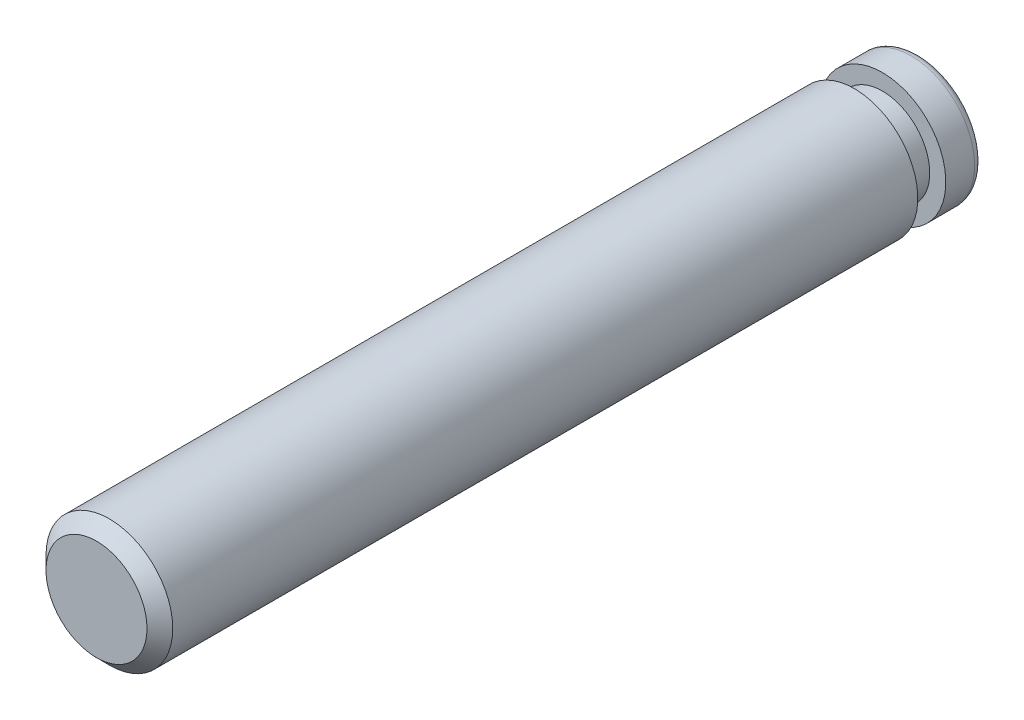
ISO-10303-21;
HEADER;
FILE_DESCRIPTION(('STEP AP214'),'2;1');
FILE_NAME('part.step','',(''),(''),'','','');
FILE_SCHEMA(('AUTOMOTIVE_DESIGN { 1 0 10303 214 1 1 1 1 }'));
ENDSEC;
DATA;
#1=APPLICATION_CONTEXT('core data for automotive mechanical design processes');
#2=APPLICATION_PROTOCOL_DEFINITION('international standard','automotive_design',2000,#1);
#3=PRODUCT_CONTEXT('',#1,'mechanical');
#4=PRODUCT('Part','Part','',(#3));
#5=PRODUCT_RELATED_PRODUCT_CATEGORY('part','',(#4));
#6=PRODUCT_DEFINITION_FORMATION('','',#4);
#7=PRODUCT_DEFINITION_CONTEXT('part definition',#1,'design');
#8=PRODUCT_DEFINITION('design','',#6,#7);
#9=PRODUCT_DEFINITION_SHAPE('','',#8);
#10=(LENGTH_UNIT() NAMED_UNIT(*) SI_UNIT(.MILLI.,.METRE.));
#11=(NAMED_UNIT(*) PLANE_ANGLE_UNIT() SI_UNIT($,.RADIAN.));
#12=(NAMED_UNIT(*) SI_UNIT($,.STERADIAN.) SOLID_ANGLE_UNIT());
#13=UNCERTAINTY_MEASURE_WITH_UNIT(LENGTH_MEASURE(1.E-05),#10,'distance_accuracy_value','');
#14=(GEOMETRIC_REPRESENTATION_CONTEXT(3) GLOBAL_UNCERTAINTY_ASSIGNED_CONTEXT((#13)) GLOBAL_UNIT_ASSIGNED_CONTEXT((#10,
#11,#12)) REPRESENTATION_CONTEXT('',''));
#15=CARTESIAN_POINT('',(0.,0.,0.));
#16=DIRECTION('',(0.,0.,1.));
#17=DIRECTION('',(1.,0.,0.));
#18=AXIS2_PLACEMENT_3D('',#15,#16,#17);
#19=CARTESIAN_POINT('',(0.,0.,12.7));
#20=DIRECTION('',(0.,0.,-1.));
#21=DIRECTION('',(-1.,0.,0.));
#22=AXIS2_PLACEMENT_3D('',#19,#20,#21);
#23=CYLINDRICAL_SURFACE('',#22,1.9558);
#24=CARTESIAN_POINT('',(0.,0.,12.303125));
#25=DIRECTION('',(0.,0.,1.));
#26=DIRECTION('',(1.,0.,0.));
#27=AXIS2_PLACEMENT_3D('',#24,#25,#26);
#28=CIRCLE('',#27,1.9558);
#29=CARTESIAN_POINT('',(1.9558,0.,12.303125));
#30=VERTEX_POINT('',#29);
#31=EDGE_CURVE('E10',#30,#30,#28,.F.);
#32=ORIENTED_EDGE('',*,*,#31,.T.);
#33=EDGE_LOOP('',(#32));
#34=FACE_BOUND('',#33,.T.);
#35=CARTESIAN_POINT('',(0.,0.,-10.6934));
#36=DIRECTION('',(0.,0.,-1.));
#37=DIRECTION('',(-1.,0.,0.));
#38=AXIS2_PLACEMENT_3D('',#35,#36,#37);
#39=CIRCLE('',#38,1.9558);
#40=CARTESIAN_POINT('',(-1.9558,0.,-10.6934));
#41=VERTEX_POINT('',#40);
#42=EDGE_CURVE('E53',#41,#41,#39,.T.);
#43=ORIENTED_EDGE('',*,*,#42,.F.);
#44=EDGE_LOOP('',(#43));
#45=FACE_BOUND('',#44,.T.);
#46=ADVANCED_FACE('F30',(#34,#45),#23,.T.);
#47=CARTESIAN_POINT('',(0.,0.,12.7));
#48=DIRECTION('',(0.,0.,1.));
#49=DIRECTION('',(1.,0.,0.));
#50=AXIS2_PLACEMENT_3D('',#47,#48,#49);
#51=PLANE('',#50);
#52=CARTESIAN_POINT('',(0.,0.,12.7));
#53=DIRECTION('',(0.,0.,1.));
#54=DIRECTION('',(1.,0.,0.));
#55=AXIS2_PLACEMENT_3D('',#52,#53,#54);
#56=CIRCLE('',#55,1.558925);
#57=CARTESIAN_POINT('',(1.558925,0.,12.7));
#58=VERTEX_POINT('',#57);
#59=EDGE_CURVE('E37',#58,#58,#56,.T.);
#60=ORIENTED_EDGE('',*,*,#59,.T.);
#61=EDGE_LOOP('',(#60));
#62=FACE_BOUND('',#61,.T.);
#63=ADVANCED_FACE('F69',(#62),#51,.T.);
#64=CARTESIAN_POINT('',(0.,0.,-10.042474892396));
#65=DIRECTION('',(0.,0.,-1.));
#66=DIRECTION('',(-1.,0.,0.));
#67=AXIS2_PLACEMENT_3D('',#64,#65,#66);
#68=CYLINDRICAL_SURFACE('',#67,1.4605);
#69=CARTESIAN_POINT('',(0.,0.,-10.6934));
#70=DIRECTION('',(0.,0.,-1.));
#71=DIRECTION('',(-1.,0.,0.));
#72=AXIS2_PLACEMENT_3D('',#69,#70,#71);
#73=CIRCLE('',#72,1.4605);
#74=CARTESIAN_POINT('',(-1.4605,0.,-10.6934));
#75=VERTEX_POINT('',#74);
#76=EDGE_CURVE('E50',#75,#75,#73,.T.);
#77=ORIENTED_EDGE('',*,*,#76,.T.);
#78=EDGE_LOOP('',(#77));
#79=FACE_BOUND('',#78,.T.);
#80=CARTESIAN_POINT('',(0.,0.,-11.557));
#81=DIRECTION('',(0.,0.,-1.));
#82=DIRECTION('',(-1.,0.,0.));
#83=AXIS2_PLACEMENT_3D('',#80,#81,#82);
#84=CIRCLE('',#83,1.4605);
#85=CARTESIAN_POINT('',(-1.4605,0.,-11.557));
#86=VERTEX_POINT('',#85);
#87=EDGE_CURVE('E59',#86,#86,#84,.T.);
#88=ORIENTED_EDGE('',*,*,#87,.F.);
#89=EDGE_LOOP('',(#88));
#90=FACE_BOUND('',#89,.T.);
#91=ADVANCED_FACE('F66',(#79,#90),#68,.T.);
#92=CARTESIAN_POINT('',(1.4605,0.,-10.6934));
#93=DIRECTION('',(0.,0.,-1.));
#94=DIRECTION('',(-1.,0.,0.));
#95=AXIS2_PLACEMENT_3D('',#92,#93,#94);
#96=PLANE('',#95);
#97=ORIENTED_EDGE('',*,*,#42,.T.);
#98=EDGE_LOOP('',(#97));
#99=FACE_BOUND('',#98,.T.);
#100=ORIENTED_EDGE('',*,*,#76,.F.);
#101=EDGE_LOOP('',(#100));
#102=FACE_BOUND('',#101,.T.);
#103=ADVANCED_FACE('F68',(#99,#102),#96,.T.);
#104=CARTESIAN_POINT('',(1.4605,0.,-11.557));
#105=DIRECTION('',(0.,0.,1.));
#106=DIRECTION('',(1.,0.,0.));
#107=AXIS2_PLACEMENT_3D('',#104,#105,#106);
#108=PLANE('',#107);
#109=ORIENTED_EDGE('',*,*,#87,.T.);
#110=EDGE_LOOP('',(#109));
#111=FACE_BOUND('',#110,.T.);
#112=CARTESIAN_POINT('',(0.,0.,-11.557));
#113=DIRECTION('',(0.,0.,-1.));
#114=DIRECTION('',(-1.,0.,0.));
#115=AXIS2_PLACEMENT_3D('',#112,#113,#114);
#116=CIRCLE('',#115,1.9558);
#117=CARTESIAN_POINT('',(-1.9558,0.,-11.557));
#118=VERTEX_POINT('',#117);
#119=EDGE_CURVE('E56',#118,#118,#116,.T.);
#120=ORIENTED_EDGE('',*,*,#119,.F.);
#121=EDGE_LOOP('',(#120));
#122=FACE_BOUND('',#121,.T.);
#123=ADVANCED_FACE('F63',(#111,#122),#108,.T.);
#124=CARTESIAN_POINT('',(0.,0.,-12.7));
#125=DIRECTION('',(0.,0.,1.));
#126=DIRECTION('',(1.,0.,0.));
#127=AXIS2_PLACEMENT_3D('',#124,#125,#126);
#128=PLANE('',#127);
#129=CARTESIAN_POINT('',(0.,0.,-12.7));
#130=DIRECTION('',(0.,0.,1.));
#131=DIRECTION('',(1.,0.,0.));
#132=AXIS2_PLACEMENT_3D('',#129,#130,#131);
#133=CIRCLE('',#132,1.7018);
#134=CARTESIAN_POINT('',(1.7018,0.,-12.7));
#135=VERTEX_POINT('',#134);
#136=EDGE_CURVE('E41',#135,#135,#133,.F.);
#137=ORIENTED_EDGE('',*,*,#136,.T.);
#138=EDGE_LOOP('',(#137));
#139=FACE_BOUND('',#138,.T.);
#140=ADVANCED_FACE('F88',(#139),#128,.F.);
#141=CARTESIAN_POINT('',(0.,0.,-12.446));
#142=DIRECTION('',(0.,0.,1.));
#143=DIRECTION('',(1.,0.,0.));
#144=AXIS2_PLACEMENT_3D('',#141,#142,#143);
#145=CIRCLE('',#144,1.9558);
#146=CARTESIAN_POINT('',(1.9558,0.,-12.446));
#147=VERTEX_POINT('',#146);
#148=EDGE_CURVE('E45',#147,#147,#145,.T.);
#149=ORIENTED_EDGE('',*,*,#148,.T.);
#150=EDGE_LOOP('',(#149));
#151=FACE_BOUND('',#150,.T.);
#152=ORIENTED_EDGE('',*,*,#119,.T.);
#153=EDGE_LOOP('',(#152));
#154=FACE_BOUND('',#153,.T.);
#155=ADVANCED_FACE('F81',(#151,#154),#23,.T.);
#156=CARTESIAN_POINT('',(0.,0.,-12.446));
#157=DIRECTION('',(0.,0.,1.));
#158=DIRECTION('',(1.,0.,0.));
#159=AXIS2_PLACEMENT_3D('',#156,#157,#158);
#160=TOROIDAL_SURFACE('',#159,1.7018,0.254);
#161=ORIENTED_EDGE('',*,*,#136,.F.);
#162=EDGE_LOOP('',(#161));
#163=FACE_BOUND('',#162,.T.);
#164=ORIENTED_EDGE('',*,*,#148,.F.);
#165=EDGE_LOOP('',(#164));
#166=FACE_BOUND('',#165,.T.);
#167=ADVANCED_FACE('F87',(#163,#166),#160,.T.);
#168=CARTESIAN_POINT('',(0.,0.,12.7));
#169=DIRECTION('',(0.,0.,-1.));
#170=DIRECTION('',(-1.,0.,0.));
#171=AXIS2_PLACEMENT_3D('',#168,#169,#170);
#172=CONICAL_SURFACE('',#171,1.558925,0.785398163397449);
#173=ORIENTED_EDGE('',*,*,#31,.F.);
#174=EDGE_LOOP('',(#173));
#175=FACE_BOUND('',#174,.T.);
#176=ORIENTED_EDGE('',*,*,#59,.F.);
#177=EDGE_LOOP('',(#176));
#178=FACE_BOUND('',#177,.T.);
#179=ADVANCED_FACE('F32',(#175,#178),#172,.T.);
#180=CLOSED_SHELL('',(#46,#63,#91,#103,#123,#140,#155,#167,#179));
#181=MANIFOLD_SOLID_BREP('B2',#180);
#182=ADVANCED_BREP_SHAPE_REPRESENTATION('',(#18,#181),#14);
#183=SHAPE_DEFINITION_REPRESENTATION(#9,#182);
ENDSEC;
END-ISO-10303-21;
